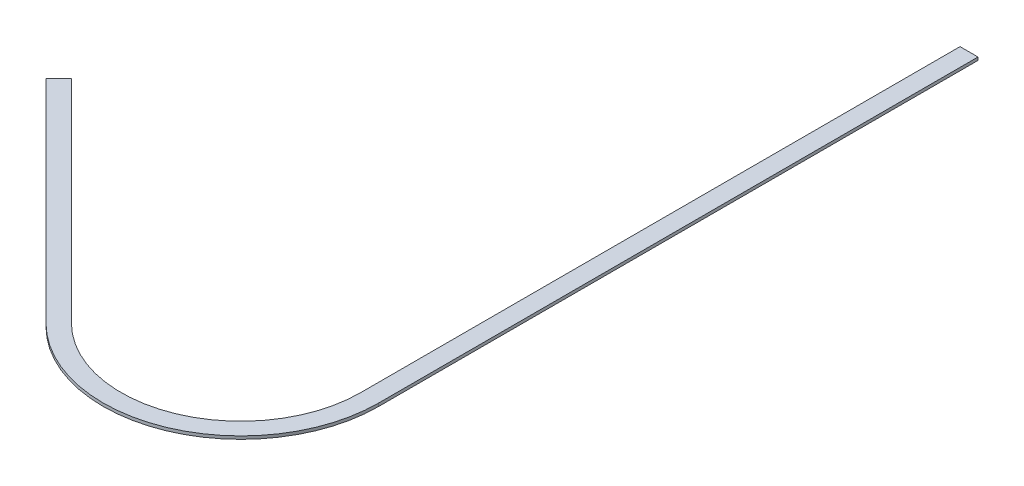
ISO-10303-21;
HEADER;
FILE_DESCRIPTION(('STEP AP214'),'2;1');
FILE_NAME('part.step','',(''),(''),'','','');
FILE_SCHEMA(('AUTOMOTIVE_DESIGN { 1 0 10303 214 1 1 1 1 }'));
ENDSEC;
DATA;
#1=APPLICATION_CONTEXT('core data for automotive mechanical design processes');
#2=APPLICATION_PROTOCOL_DEFINITION('international standard','automotive_design',2000,#1);
#3=PRODUCT_CONTEXT('',#1,'mechanical');
#4=PRODUCT('Part','Part','',(#3));
#5=PRODUCT_RELATED_PRODUCT_CATEGORY('part','',(#4));
#6=PRODUCT_DEFINITION_FORMATION('','',#4);
#7=PRODUCT_DEFINITION_CONTEXT('part definition',#1,'design');
#8=PRODUCT_DEFINITION('design','',#6,#7);
#9=PRODUCT_DEFINITION_SHAPE('','',#8);
#10=(LENGTH_UNIT() NAMED_UNIT(*) SI_UNIT(.MILLI.,.METRE.));
#11=(NAMED_UNIT(*) PLANE_ANGLE_UNIT() SI_UNIT($,.RADIAN.));
#12=(NAMED_UNIT(*) SI_UNIT($,.STERADIAN.) SOLID_ANGLE_UNIT());
#13=UNCERTAINTY_MEASURE_WITH_UNIT(LENGTH_MEASURE(1.E-05),#10,'distance_accuracy_value','');
#14=(GEOMETRIC_REPRESENTATION_CONTEXT(3) GLOBAL_UNCERTAINTY_ASSIGNED_CONTEXT((#13)) GLOBAL_UNIT_ASSIGNED_CONTEXT((#10,
#11,#12)) REPRESENTATION_CONTEXT('',''));
#15=CARTESIAN_POINT('',(0.,0.,0.));
#16=DIRECTION('',(0.,0.,1.));
#17=DIRECTION('',(1.,0.,0.));
#18=AXIS2_PLACEMENT_3D('',#15,#16,#17);
#19=CARTESIAN_POINT('',(30.0000000000001,5.,-600.));
#20=DIRECTION('',(0.,0.,1.));
#21=DIRECTION('',(1.,0.,0.));
#22=AXIS2_PLACEMENT_3D('',#19,#20,#21);
#23=PLANE('',#22);
#24=DIRECTION('',(-1.,0.,0.));
#25=VECTOR('',#24,1.);
#26=CARTESIAN_POINT('',(30.0000000000001,0.,-600.));
#27=LINE('',#26,#25);
#28=CARTESIAN_POINT('',(30.0000000000001,0.,-600.));
#29=VERTEX_POINT('',#28);
#30=CARTESIAN_POINT('',(0.,0.,-600.));
#31=VERTEX_POINT('',#30);
#32=EDGE_CURVE('E129',#29,#31,#27,.T.);
#33=ORIENTED_EDGE('',*,*,#32,.T.);
#34=DIRECTION('',(0.,-1.,0.));
#35=VECTOR('',#34,1.);
#36=CARTESIAN_POINT('',(0.,5.,-600.));
#37=LINE('',#36,#35);
#38=CARTESIAN_POINT('',(0.,5.,-600.));
#39=VERTEX_POINT('',#38);
#40=EDGE_CURVE('E11',#39,#31,#37,.T.);
#41=ORIENTED_EDGE('',*,*,#40,.F.);
#42=DIRECTION('',(-1.,0.,0.));
#43=VECTOR('',#42,1.);
#44=CARTESIAN_POINT('',(30.0000000000001,5.,-600.));
#45=LINE('',#44,#43);
#46=CARTESIAN_POINT('',(30.0000000000001,5.,-600.));
#47=VERTEX_POINT('',#46);
#48=EDGE_CURVE('E143',#47,#39,#45,.T.);
#49=ORIENTED_EDGE('',*,*,#48,.F.);
#50=DIRECTION('',(0.,-1.,0.));
#51=VECTOR('',#50,1.);
#52=CARTESIAN_POINT('',(30.0000000000001,5.,-600.));
#53=LINE('',#52,#51);
#54=EDGE_CURVE('E125',#47,#29,#53,.T.);
#55=ORIENTED_EDGE('',*,*,#54,.T.);
#56=EDGE_LOOP('',(#33,#41,#49,#55));
#57=FACE_BOUND('',#56,.T.);
#58=ADVANCED_FACE('F33',(#57),#23,.F.);
#59=CARTESIAN_POINT('',(0.,5.,-600.));
#60=DIRECTION('',(1.,0.,0.));
#61=DIRECTION('',(0.,0.,-1.));
#62=AXIS2_PLACEMENT_3D('',#59,#60,#61);
#63=PLANE('',#62);
#64=DIRECTION('',(0.,0.,1.));
#65=VECTOR('',#64,1.);
#66=CARTESIAN_POINT('',(0.,0.,-600.));
#67=LINE('',#66,#65);
#68=CARTESIAN_POINT('',(0.,0.,400.));
#69=VERTEX_POINT('',#68);
#70=EDGE_CURVE('E132',#31,#69,#67,.T.);
#71=ORIENTED_EDGE('',*,*,#70,.T.);
#72=DIRECTION('',(0.,-1.,0.));
#73=VECTOR('',#72,1.);
#74=CARTESIAN_POINT('',(0.,5.,400.));
#75=LINE('',#74,#73);
#76=CARTESIAN_POINT('',(0.,5.,400.));
#77=VERTEX_POINT('',#76);
#78=EDGE_CURVE('E41',#77,#69,#75,.T.);
#79=ORIENTED_EDGE('',*,*,#78,.F.);
#80=DIRECTION('',(0.,0.,1.));
#81=VECTOR('',#80,1.);
#82=CARTESIAN_POINT('',(0.,5.,-600.));
#83=LINE('',#82,#81);
#84=EDGE_CURVE('E92',#39,#77,#83,.T.);
#85=ORIENTED_EDGE('',*,*,#84,.F.);
#86=ORIENTED_EDGE('',*,*,#40,.T.);
#87=EDGE_LOOP('',(#71,#79,#85,#86));
#88=FACE_BOUND('',#87,.T.);
#89=ADVANCED_FACE('F178',(#88),#63,.F.);
#90=CARTESIAN_POINT('',(-200.,5.,400.));
#91=DIRECTION('',(0.,-1.,0.));
#92=DIRECTION('',(0.,0.,-1.));
#93=AXIS2_PLACEMENT_3D('',#90,#91,#92);
#94=CYLINDRICAL_SURFACE('',#93,200.);
#95=CARTESIAN_POINT('',(-200.,0.,400.));
#96=DIRECTION('',(0.,-1.,0.));
#97=DIRECTION('',(0.,0.,-1.));
#98=AXIS2_PLACEMENT_3D('',#95,#96,#97);
#99=CIRCLE('',#98,200.);
#100=CARTESIAN_POINT('',(-341.42135623731,0.,541.421356237309));
#101=VERTEX_POINT('',#100);
#102=EDGE_CURVE('E134',#69,#101,#99,.T.);
#103=ORIENTED_EDGE('',*,*,#102,.T.);
#104=DIRECTION('',(0.,-1.,0.));
#105=VECTOR('',#104,1.);
#106=CARTESIAN_POINT('',(-341.42135623731,5.,541.421356237309));
#107=LINE('',#106,#105);
#108=CARTESIAN_POINT('',(-341.42135623731,5.,541.421356237309));
#109=VERTEX_POINT('',#108);
#110=EDGE_CURVE('E150',#109,#101,#107,.T.);
#111=ORIENTED_EDGE('',*,*,#110,.F.);
#112=CARTESIAN_POINT('',(-200.,5.,400.));
#113=DIRECTION('',(0.,-1.,0.));
#114=DIRECTION('',(0.,0.,-1.));
#115=AXIS2_PLACEMENT_3D('',#112,#113,#114);
#116=CIRCLE('',#115,200.);
#117=EDGE_CURVE('E158',#77,#109,#116,.T.);
#118=ORIENTED_EDGE('',*,*,#117,.F.);
#119=ORIENTED_EDGE('',*,*,#78,.T.);
#120=EDGE_LOOP('',(#103,#111,#118,#119));
#121=FACE_BOUND('',#120,.T.);
#122=ADVANCED_FACE('F156',(#121),#94,.F.);
#123=CARTESIAN_POINT('',(-341.42135623731,5.,541.421356237309));
#124=DIRECTION('',(-0.707106781186551,0.,0.707106781186544));
#125=DIRECTION('',(0.707106781186544,0.,0.707106781186551));
#126=AXIS2_PLACEMENT_3D('',#123,#124,#125);
#127=PLANE('',#126);
#128=DIRECTION('',(-0.707106781186544,0.,-0.707106781186551));
#129=VECTOR('',#128,1.);
#130=CARTESIAN_POINT('',(-341.42135623731,0.,541.421356237309));
#131=LINE('',#130,#129);
#132=CARTESIAN_POINT('',(-694.974746830582,0.,187.867965644034));
#133=VERTEX_POINT('',#132);
#134=EDGE_CURVE('E136',#101,#133,#131,.T.);
#135=ORIENTED_EDGE('',*,*,#134,.T.);
#136=DIRECTION('',(0.,-1.,0.));
#137=VECTOR('',#136,1.);
#138=CARTESIAN_POINT('',(-694.974746830582,5.,187.867965644034));
#139=LINE('',#138,#137);
#140=CARTESIAN_POINT('',(-694.974746830582,5.,187.867965644034));
#141=VERTEX_POINT('',#140);
#142=EDGE_CURVE('E147',#141,#133,#139,.T.);
#143=ORIENTED_EDGE('',*,*,#142,.F.);
#144=DIRECTION('',(-0.707106781186544,0.,-0.707106781186551));
#145=VECTOR('',#144,1.);
#146=CARTESIAN_POINT('',(-341.42135623731,5.,541.421356237309));
#147=LINE('',#146,#145);
#148=EDGE_CURVE('E170',#109,#141,#147,.T.);
#149=ORIENTED_EDGE('',*,*,#148,.F.);
#150=ORIENTED_EDGE('',*,*,#110,.T.);
#151=EDGE_LOOP('',(#135,#143,#149,#150));
#152=FACE_BOUND('',#151,.T.);
#153=ADVANCED_FACE('F166',(#152),#127,.F.);
#154=CARTESIAN_POINT('',(-694.974746830582,5.,187.867965644034));
#155=DIRECTION('',(0.707106781186547,0.,0.707106781186548));
#156=DIRECTION('',(0.707106781186548,0.,-0.707106781186547));
#157=AXIS2_PLACEMENT_3D('',#154,#155,#156);
#158=PLANE('',#157);
#159=DIRECTION('',(-0.707106781186548,0.,0.707106781186547));
#160=VECTOR('',#159,1.);
#161=CARTESIAN_POINT('',(-694.974746830582,0.,187.867965644034));
#162=LINE('',#161,#160);
#163=CARTESIAN_POINT('',(-716.187950266179,0.,209.08116907963));
#164=VERTEX_POINT('',#163);
#165=EDGE_CURVE('E138',#133,#164,#162,.T.);
#166=ORIENTED_EDGE('',*,*,#165,.T.);
#167=DIRECTION('',(0.,-1.,0.));
#168=VECTOR('',#167,1.);
#169=CARTESIAN_POINT('',(-716.187950266179,5.,209.08116907963));
#170=LINE('',#169,#168);
#171=CARTESIAN_POINT('',(-716.187950266179,5.,209.08116907963));
#172=VERTEX_POINT('',#171);
#173=EDGE_CURVE('E120',#172,#164,#170,.T.);
#174=ORIENTED_EDGE('',*,*,#173,.F.);
#175=DIRECTION('',(-0.707106781186548,0.,0.707106781186547));
#176=VECTOR('',#175,1.);
#177=CARTESIAN_POINT('',(-694.974746830582,5.,187.867965644034));
#178=LINE('',#177,#176);
#179=EDGE_CURVE('E111',#141,#172,#178,.T.);
#180=ORIENTED_EDGE('',*,*,#179,.F.);
#181=ORIENTED_EDGE('',*,*,#142,.T.);
#182=EDGE_LOOP('',(#166,#174,#180,#181));
#183=FACE_BOUND('',#182,.T.);
#184=ADVANCED_FACE('F169',(#183),#158,.F.);
#185=CARTESIAN_POINT('',(-716.187950266179,5.,209.08116907963));
#186=DIRECTION('',(0.707106781186551,0.,-0.707106781186544));
#187=DIRECTION('',(-0.707106781186544,0.,-0.707106781186551));
#188=AXIS2_PLACEMENT_3D('',#185,#186,#187);
#189=PLANE('',#188);
#190=DIRECTION('',(0.707106781186544,0.,0.707106781186551));
#191=VECTOR('',#190,1.);
#192=CARTESIAN_POINT('',(-716.187950266179,0.,209.08116907963));
#193=LINE('',#192,#191);
#194=CARTESIAN_POINT('',(-362.634559672907,0.,562.634559672905));
#195=VERTEX_POINT('',#194);
#196=EDGE_CURVE('E119',#164,#195,#193,.T.);
#197=ORIENTED_EDGE('',*,*,#196,.T.);
#198=DIRECTION('',(0.,-1.,0.));
#199=VECTOR('',#198,1.);
#200=CARTESIAN_POINT('',(-362.634559672907,5.,562.634559672905));
#201=LINE('',#200,#199);
#202=CARTESIAN_POINT('',(-362.634559672907,5.,562.634559672905));
#203=VERTEX_POINT('',#202);
#204=EDGE_CURVE('E116',#203,#195,#201,.T.);
#205=ORIENTED_EDGE('',*,*,#204,.F.);
#206=DIRECTION('',(0.707106781186544,0.,0.707106781186551));
#207=VECTOR('',#206,1.);
#208=CARTESIAN_POINT('',(-716.187950266179,5.,209.08116907963));
#209=LINE('',#208,#207);
#210=EDGE_CURVE('E105',#172,#203,#209,.T.);
#211=ORIENTED_EDGE('',*,*,#210,.F.);
#212=ORIENTED_EDGE('',*,*,#173,.T.);
#213=EDGE_LOOP('',(#197,#205,#211,#212));
#214=FACE_BOUND('',#213,.T.);
#215=ADVANCED_FACE('F117',(#214),#189,.F.);
#216=CARTESIAN_POINT('',(-200.,5.,400.));
#217=DIRECTION('',(0.,-1.,0.));
#218=DIRECTION('',(0.,0.,-1.));
#219=AXIS2_PLACEMENT_3D('',#216,#217,#218);
#220=CYLINDRICAL_SURFACE('',#219,230.);
#221=CARTESIAN_POINT('',(-200.,0.,400.));
#222=DIRECTION('',(0.,1.,0.));
#223=DIRECTION('',(0.,0.,-1.));
#224=AXIS2_PLACEMENT_3D('',#221,#222,#223);
#225=CIRCLE('',#224,230.);
#226=CARTESIAN_POINT('',(30.0000000000001,0.,400.));
#227=VERTEX_POINT('',#226);
#228=EDGE_CURVE('E78',#195,#227,#225,.T.);
#229=ORIENTED_EDGE('',*,*,#228,.T.);
#230=DIRECTION('',(0.,-1.,0.));
#231=VECTOR('',#230,1.);
#232=CARTESIAN_POINT('',(30.0000000000001,5.,400.));
#233=LINE('',#232,#231);
#234=CARTESIAN_POINT('',(30.0000000000001,5.,400.));
#235=VERTEX_POINT('',#234);
#236=EDGE_CURVE('E121',#235,#227,#233,.T.);
#237=ORIENTED_EDGE('',*,*,#236,.F.);
#238=CARTESIAN_POINT('',(-200.,5.,400.));
#239=DIRECTION('',(0.,1.,0.));
#240=DIRECTION('',(0.,0.,-1.));
#241=AXIS2_PLACEMENT_3D('',#238,#239,#240);
#242=CIRCLE('',#241,230.);
#243=EDGE_CURVE('E109',#203,#235,#242,.T.);
#244=ORIENTED_EDGE('',*,*,#243,.F.);
#245=ORIENTED_EDGE('',*,*,#204,.T.);
#246=EDGE_LOOP('',(#229,#237,#244,#245));
#247=FACE_BOUND('',#246,.T.);
#248=ADVANCED_FACE('F123',(#247),#220,.T.);
#249=CARTESIAN_POINT('',(30.0000000000001,5.,400.));
#250=DIRECTION('',(-1.,0.,0.));
#251=DIRECTION('',(0.,0.,1.));
#252=AXIS2_PLACEMENT_3D('',#249,#250,#251);
#253=PLANE('',#252);
#254=DIRECTION('',(0.,0.,-1.));
#255=VECTOR('',#254,1.);
#256=CARTESIAN_POINT('',(30.0000000000001,0.,400.));
#257=LINE('',#256,#255);
#258=EDGE_CURVE('E84',#227,#29,#257,.T.);
#259=ORIENTED_EDGE('',*,*,#258,.T.);
#260=ORIENTED_EDGE('',*,*,#54,.F.);
#261=DIRECTION('',(0.,0.,-1.));
#262=VECTOR('',#261,1.);
#263=CARTESIAN_POINT('',(30.0000000000001,5.,400.));
#264=LINE('',#263,#262);
#265=EDGE_CURVE('E49',#235,#47,#264,.T.);
#266=ORIENTED_EDGE('',*,*,#265,.F.);
#267=ORIENTED_EDGE('',*,*,#236,.T.);
#268=EDGE_LOOP('',(#259,#260,#266,#267));
#269=FACE_BOUND('',#268,.T.);
#270=ADVANCED_FACE('F194',(#269),#253,.F.);
#271=CARTESIAN_POINT('',(-200.,5.,400.));
#272=DIRECTION('',(0.,-1.,0.));
#273=DIRECTION('',(0.,0.,-1.));
#274=AXIS2_PLACEMENT_3D('',#271,#272,#273);
#275=PLANE('',#274);
#276=ORIENTED_EDGE('',*,*,#48,.T.);
#277=ORIENTED_EDGE('',*,*,#84,.T.);
#278=ORIENTED_EDGE('',*,*,#117,.T.);
#279=ORIENTED_EDGE('',*,*,#148,.T.);
#280=ORIENTED_EDGE('',*,*,#179,.T.);
#281=ORIENTED_EDGE('',*,*,#210,.T.);
#282=ORIENTED_EDGE('',*,*,#243,.T.);
#283=ORIENTED_EDGE('',*,*,#265,.T.);
#284=EDGE_LOOP('',(#276,#277,#278,#279,#280,#281,#282,#283));
#285=FACE_BOUND('',#284,.T.);
#286=ADVANCED_FACE('F107',(#285),#275,.F.);
#287=CARTESIAN_POINT('',(-200.,0.,400.));
#288=DIRECTION('',(0.,-1.,0.));
#289=DIRECTION('',(0.,0.,-1.));
#290=AXIS2_PLACEMENT_3D('',#287,#288,#289);
#291=PLANE('',#290);
#292=ORIENTED_EDGE('',*,*,#32,.F.);
#293=ORIENTED_EDGE('',*,*,#258,.F.);
#294=ORIENTED_EDGE('',*,*,#228,.F.);
#295=ORIENTED_EDGE('',*,*,#196,.F.);
#296=ORIENTED_EDGE('',*,*,#165,.F.);
#297=ORIENTED_EDGE('',*,*,#134,.F.);
#298=ORIENTED_EDGE('',*,*,#102,.F.);
#299=ORIENTED_EDGE('',*,*,#70,.F.);
#300=EDGE_LOOP('',(#292,#293,#294,#295,#296,#297,#298,#299));
#301=FACE_BOUND('',#300,.T.);
#302=ADVANCED_FACE('F162',(#301),#291,.T.);
#303=CLOSED_SHELL('',(#58,#89,#122,#153,#184,#215,#248,#270,#286,#302));
#304=MANIFOLD_SOLID_BREP('B2',#303);
#305=ADVANCED_BREP_SHAPE_REPRESENTATION('',(#18,#304),#14);
#306=SHAPE_DEFINITION_REPRESENTATION(#9,#305);
ENDSEC;
END-ISO-10303-21;
